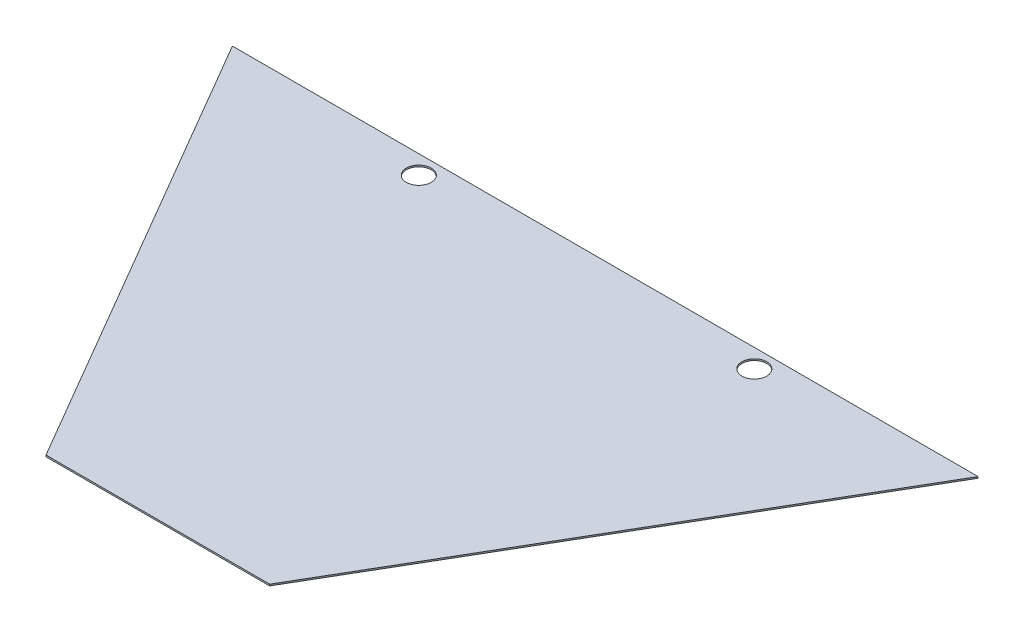
ISO-10303-21;
HEADER;
FILE_DESCRIPTION(('STEP AP214'),'2;1');
FILE_NAME('part.step','',(''),(''),'','','');
FILE_SCHEMA(('AUTOMOTIVE_DESIGN { 1 0 10303 214 1 1 1 1 }'));
ENDSEC;
DATA;
#1=APPLICATION_CONTEXT('core data for automotive mechanical design processes');
#2=APPLICATION_PROTOCOL_DEFINITION('international standard','automotive_design',2000,#1);
#3=PRODUCT_CONTEXT('',#1,'mechanical');
#4=PRODUCT('Part','Part','',(#3));
#5=PRODUCT_RELATED_PRODUCT_CATEGORY('part','',(#4));
#6=PRODUCT_DEFINITION_FORMATION('','',#4);
#7=PRODUCT_DEFINITION_CONTEXT('part definition',#1,'design');
#8=PRODUCT_DEFINITION('design','',#6,#7);
#9=PRODUCT_DEFINITION_SHAPE('','',#8);
#10=(LENGTH_UNIT() NAMED_UNIT(*) SI_UNIT(.MILLI.,.METRE.));
#11=(NAMED_UNIT(*) PLANE_ANGLE_UNIT() SI_UNIT($,.RADIAN.));
#12=(NAMED_UNIT(*) SI_UNIT($,.STERADIAN.) SOLID_ANGLE_UNIT());
#13=UNCERTAINTY_MEASURE_WITH_UNIT(LENGTH_MEASURE(1.E-05),#10,'distance_accuracy_value','');
#14=(GEOMETRIC_REPRESENTATION_CONTEXT(3) GLOBAL_UNCERTAINTY_ASSIGNED_CONTEXT((#13)) GLOBAL_UNIT_ASSIGNED_CONTEXT((#10,
#11,#12)) REPRESENTATION_CONTEXT('',''));
#15=CARTESIAN_POINT('',(0.,0.,0.));
#16=DIRECTION('',(0.,0.,1.));
#17=DIRECTION('',(1.,0.,0.));
#18=AXIS2_PLACEMENT_3D('',#15,#16,#17);
#19=CARTESIAN_POINT('',(-533.4,3.175,-914.4));
#20=DIRECTION('',(0.863778900898433,0.,-0.503871025524086));
#21=DIRECTION('',(-0.503871025524087,0.,-0.863778900898434));
#22=AXIS2_PLACEMENT_3D('',#19,#20,#21);
#23=PLANE('',#22);
#24=DIRECTION('',(0.503871025524086,0.,0.863778900898433));
#25=VECTOR('',#24,1.);
#26=CARTESIAN_POINT('',(-533.4,0.,-914.4));
#27=LINE('',#26,#25);
#28=CARTESIAN_POINT('',(-533.4,0.,-914.4));
#29=VERTEX_POINT('',#28);
#30=CARTESIAN_POINT('',(0.,0.,0.));
#31=VERTEX_POINT('',#30);
#32=EDGE_CURVE('E80',#29,#31,#27,.T.);
#33=ORIENTED_EDGE('',*,*,#32,.T.);
#34=DIRECTION('',(0.,-1.,0.));
#35=VECTOR('',#34,1.);
#36=CARTESIAN_POINT('',(0.,3.175,0.));
#37=LINE('',#36,#35);
#38=CARTESIAN_POINT('',(0.,3.175,0.));
#39=VERTEX_POINT('',#38);
#40=EDGE_CURVE('E11',#39,#31,#37,.T.);
#41=ORIENTED_EDGE('',*,*,#40,.F.);
#42=DIRECTION('',(0.503871025524086,0.,0.863778900898433));
#43=VECTOR('',#42,1.);
#44=CARTESIAN_POINT('',(-533.4,3.175,-914.4));
#45=LINE('',#44,#43);
#46=CARTESIAN_POINT('',(-533.4,3.175,-914.4));
#47=VERTEX_POINT('',#46);
#48=EDGE_CURVE('E68',#47,#39,#45,.T.);
#49=ORIENTED_EDGE('',*,*,#48,.F.);
#50=DIRECTION('',(0.,-1.,0.));
#51=VECTOR('',#50,1.);
#52=CARTESIAN_POINT('',(-533.4,3.175,-914.4));
#53=LINE('',#52,#51);
#54=EDGE_CURVE('E76',#47,#29,#53,.T.);
#55=ORIENTED_EDGE('',*,*,#54,.T.);
#56=EDGE_LOOP('',(#33,#41,#49,#55));
#57=FACE_BOUND('',#56,.T.);
#58=ADVANCED_FACE('F17',(#57),#23,.F.);
#59=CARTESIAN_POINT('',(0.,3.175,0.));
#60=DIRECTION('',(0.,0.,-1.));
#61=DIRECTION('',(-1.,0.,0.));
#62=AXIS2_PLACEMENT_3D('',#59,#60,#61);
#63=PLANE('',#62);
#64=DIRECTION('',(1.,0.,0.));
#65=VECTOR('',#64,1.);
#66=CARTESIAN_POINT('',(0.,0.,0.));
#67=LINE('',#66,#65);
#68=CARTESIAN_POINT('',(457.2,0.,0.));
#69=VERTEX_POINT('',#68);
#70=EDGE_CURVE('E72',#31,#69,#67,.T.);
#71=ORIENTED_EDGE('',*,*,#70,.T.);
#72=DIRECTION('',(0.,-1.,0.));
#73=VECTOR('',#72,1.);
#74=CARTESIAN_POINT('',(457.2,3.175,0.));
#75=LINE('',#74,#73);
#76=CARTESIAN_POINT('',(457.2,3.175,0.));
#77=VERTEX_POINT('',#76);
#78=EDGE_CURVE('E25',#77,#69,#75,.T.);
#79=ORIENTED_EDGE('',*,*,#78,.F.);
#80=DIRECTION('',(1.,0.,0.));
#81=VECTOR('',#80,1.);
#82=CARTESIAN_POINT('',(0.,3.175,0.));
#83=LINE('',#82,#81);
#84=EDGE_CURVE('E63',#39,#77,#83,.T.);
#85=ORIENTED_EDGE('',*,*,#84,.F.);
#86=ORIENTED_EDGE('',*,*,#40,.T.);
#87=EDGE_LOOP('',(#71,#79,#85,#86));
#88=FACE_BOUND('',#87,.T.);
#89=ADVANCED_FACE('F71',(#88),#63,.F.);
#90=CARTESIAN_POINT('',(457.2,3.175,0.));
#91=DIRECTION('',(-0.863778900898434,0.,-0.503871025524086));
#92=DIRECTION('',(-0.503871025524086,0.,0.863778900898434));
#93=AXIS2_PLACEMENT_3D('',#90,#91,#92);
#94=PLANE('',#93);
#95=DIRECTION('',(0.503871025524086,0.,-0.863778900898433));
#96=VECTOR('',#95,1.);
#97=CARTESIAN_POINT('',(457.2,0.,0.));
#98=LINE('',#97,#96);
#99=CARTESIAN_POINT('',(990.6,0.,-914.4));
#100=VERTEX_POINT('',#99);
#101=EDGE_CURVE('E50',#69,#100,#98,.T.);
#102=ORIENTED_EDGE('',*,*,#101,.T.);
#103=DIRECTION('',(0.,-1.,0.));
#104=VECTOR('',#103,1.);
#105=CARTESIAN_POINT('',(990.6,3.175,-914.4));
#106=LINE('',#105,#104);
#107=CARTESIAN_POINT('',(990.6,3.175,-914.4));
#108=VERTEX_POINT('',#107);
#109=EDGE_CURVE('E73',#108,#100,#106,.T.);
#110=ORIENTED_EDGE('',*,*,#109,.F.);
#111=DIRECTION('',(0.503871025524086,0.,-0.863778900898433));
#112=VECTOR('',#111,1.);
#113=CARTESIAN_POINT('',(457.2,3.175,0.));
#114=LINE('',#113,#112);
#115=EDGE_CURVE('E66',#77,#108,#114,.T.);
#116=ORIENTED_EDGE('',*,*,#115,.F.);
#117=ORIENTED_EDGE('',*,*,#78,.T.);
#118=EDGE_LOOP('',(#102,#110,#116,#117));
#119=FACE_BOUND('',#118,.T.);
#120=ADVANCED_FACE('F74',(#119),#94,.F.);
#121=CARTESIAN_POINT('',(990.6,3.175,-914.4));
#122=DIRECTION('',(0.,0.,1.));
#123=DIRECTION('',(1.,0.,0.));
#124=AXIS2_PLACEMENT_3D('',#121,#122,#123);
#125=PLANE('',#124);
#126=DIRECTION('',(-1.,0.,0.));
#127=VECTOR('',#126,1.);
#128=CARTESIAN_POINT('',(990.6,0.,-914.4));
#129=LINE('',#128,#127);
#130=EDGE_CURVE('E56',#100,#29,#129,.T.);
#131=ORIENTED_EDGE('',*,*,#130,.T.);
#132=ORIENTED_EDGE('',*,*,#54,.F.);
#133=DIRECTION('',(-1.,0.,0.));
#134=VECTOR('',#133,1.);
#135=CARTESIAN_POINT('',(990.6,3.175,-914.4));
#136=LINE('',#135,#134);
#137=EDGE_CURVE('E33',#108,#47,#136,.T.);
#138=ORIENTED_EDGE('',*,*,#137,.F.);
#139=ORIENTED_EDGE('',*,*,#109,.T.);
#140=EDGE_LOOP('',(#131,#132,#138,#139));
#141=FACE_BOUND('',#140,.T.);
#142=ADVANCED_FACE('F88',(#141),#125,.F.);
#143=CARTESIAN_POINT('',(228.6,3.175,391.885714285715));
#144=DIRECTION('',(0.,1.,0.));
#145=DIRECTION('',(0.,0.,1.));
#146=AXIS2_PLACEMENT_3D('',#143,#144,#145);
#147=PLANE('',#146);
#148=CARTESIAN_POINT('',(571.5,3.175,-876.3));
#149=DIRECTION('',(0.,1.,0.));
#150=DIRECTION('',(0.,0.,-1.));
#151=AXIS2_PLACEMENT_3D('',#148,#149,#150);
#152=CIRCLE('',#151,25.4);
#153=CARTESIAN_POINT('',(571.5,3.175,-901.7));
#154=VERTEX_POINT('',#153);
#155=EDGE_CURVE('E102',#154,#154,#152,.T.);
#156=ORIENTED_EDGE('',*,*,#155,.F.);
#157=EDGE_LOOP('',(#156));
#158=FACE_BOUND('',#157,.T.);
#159=CARTESIAN_POINT('',(-114.3,3.175,-876.3));
#160=DIRECTION('',(0.,1.,0.));
#161=DIRECTION('',(0.,0.,1.));
#162=AXIS2_PLACEMENT_3D('',#159,#160,#161);
#163=CIRCLE('',#162,25.4);
#164=CARTESIAN_POINT('',(-114.3,3.175,-850.9));
#165=VERTEX_POINT('',#164);
#166=EDGE_CURVE('E96',#165,#165,#163,.T.);
#167=ORIENTED_EDGE('',*,*,#166,.F.);
#168=EDGE_LOOP('',(#167));
#169=FACE_BOUND('',#168,.T.);
#170=ORIENTED_EDGE('',*,*,#48,.T.);
#171=ORIENTED_EDGE('',*,*,#84,.T.);
#172=ORIENTED_EDGE('',*,*,#115,.T.);
#173=ORIENTED_EDGE('',*,*,#137,.T.);
#174=EDGE_LOOP('',(#170,#171,#172,#173));
#175=FACE_BOUND('',#174,.T.);
#176=ADVANCED_FACE('F64',(#158,#169,#175),#147,.T.);
#177=CARTESIAN_POINT('',(228.6,0.,391.885714285715));
#178=DIRECTION('',(0.,1.,0.));
#179=DIRECTION('',(0.,0.,1.));
#180=AXIS2_PLACEMENT_3D('',#177,#178,#179);
#181=PLANE('',#180);
#182=CARTESIAN_POINT('',(571.5,0.,-876.3));
#183=DIRECTION('',(0.,1.,0.));
#184=DIRECTION('',(0.,0.,1.));
#185=AXIS2_PLACEMENT_3D('',#182,#183,#184);
#186=CIRCLE('',#185,25.4);
#187=CARTESIAN_POINT('',(571.5,0.,-850.9));
#188=VERTEX_POINT('',#187);
#189=EDGE_CURVE('E99',#188,#188,#186,.F.);
#190=ORIENTED_EDGE('',*,*,#189,.F.);
#191=EDGE_LOOP('',(#190));
#192=FACE_BOUND('',#191,.T.);
#193=CARTESIAN_POINT('',(-114.3,0.,-876.3));
#194=DIRECTION('',(0.,1.,0.));
#195=DIRECTION('',(0.,0.,1.));
#196=AXIS2_PLACEMENT_3D('',#193,#194,#195);
#197=CIRCLE('',#196,25.4);
#198=CARTESIAN_POINT('',(-114.3,0.,-850.9));
#199=VERTEX_POINT('',#198);
#200=EDGE_CURVE('E83',#199,#199,#197,.F.);
#201=ORIENTED_EDGE('',*,*,#200,.F.);
#202=EDGE_LOOP('',(#201));
#203=FACE_BOUND('',#202,.T.);
#204=ORIENTED_EDGE('',*,*,#32,.F.);
#205=ORIENTED_EDGE('',*,*,#130,.F.);
#206=ORIENTED_EDGE('',*,*,#101,.F.);
#207=ORIENTED_EDGE('',*,*,#70,.F.);
#208=EDGE_LOOP('',(#204,#205,#206,#207));
#209=FACE_BOUND('',#208,.T.);
#210=ADVANCED_FACE('F91',(#192,#203,#209),#181,.F.);
#211=CARTESIAN_POINT('',(-114.3,-0.00100000000000013,-876.3));
#212=DIRECTION('',(0.,1.,0.));
#213=DIRECTION('',(0.,0.,1.));
#214=AXIS2_PLACEMENT_3D('',#211,#212,#213);
#215=CYLINDRICAL_SURFACE('',#214,25.4);
#216=ORIENTED_EDGE('',*,*,#166,.T.);
#217=EDGE_LOOP('',(#216));
#218=FACE_BOUND('',#217,.T.);
#219=ORIENTED_EDGE('',*,*,#200,.T.);
#220=EDGE_LOOP('',(#219));
#221=FACE_BOUND('',#220,.T.);
#222=ADVANCED_FACE('F114',(#218,#221),#215,.F.);
#223=CARTESIAN_POINT('',(571.5,-0.00100000000000013,-876.3));
#224=DIRECTION('',(0.,1.,0.));
#225=DIRECTION('',(0.,0.,1.));
#226=AXIS2_PLACEMENT_3D('',#223,#224,#225);
#227=CYLINDRICAL_SURFACE('',#226,25.4);
#228=ORIENTED_EDGE('',*,*,#155,.T.);
#229=EDGE_LOOP('',(#228));
#230=FACE_BOUND('',#229,.T.);
#231=ORIENTED_EDGE('',*,*,#189,.T.);
#232=EDGE_LOOP('',(#231));
#233=FACE_BOUND('',#232,.T.);
#234=ADVANCED_FACE('F106',(#230,#233),#227,.F.);
#235=CLOSED_SHELL('',(#58,#89,#120,#142,#176,#210,#222,#234));
#236=MANIFOLD_SOLID_BREP('B1',#235);
#237=ADVANCED_BREP_SHAPE_REPRESENTATION('',(#18,#236),#14);
#238=SHAPE_DEFINITION_REPRESENTATION(#9,#237);
ENDSEC;
END-ISO-10303-21;
